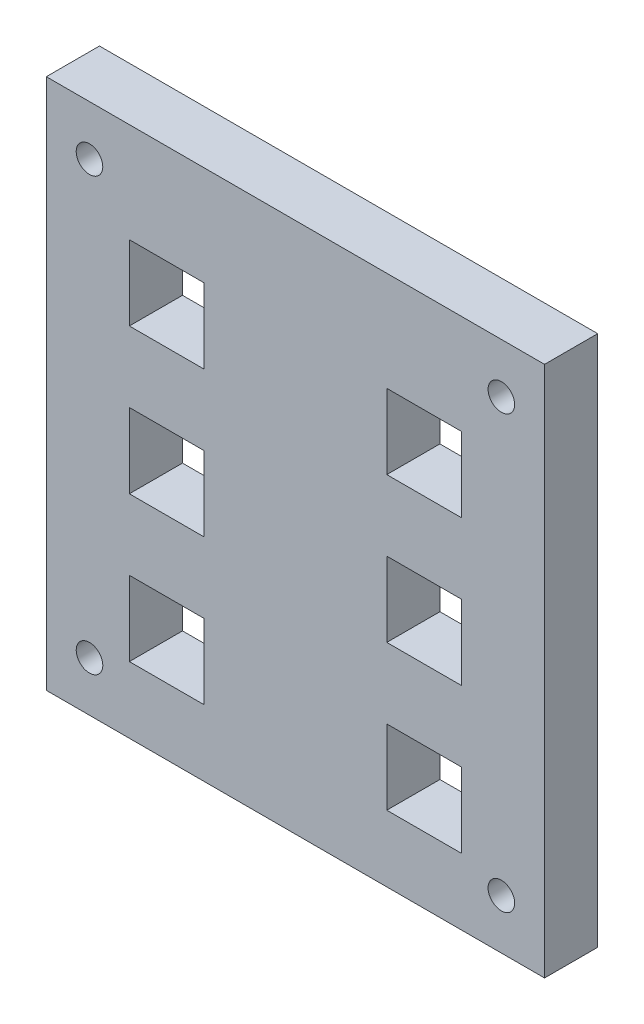
ISO-10303-21;
HEADER;
FILE_DESCRIPTION(('STEP AP214'),'2;1');
FILE_NAME('part.step','',(''),(''),'','','');
FILE_SCHEMA(('AUTOMOTIVE_DESIGN { 1 0 10303 214 1 1 1 1 }'));
ENDSEC;
DATA;
#1=APPLICATION_CONTEXT('core data for automotive mechanical design processes');
#2=APPLICATION_PROTOCOL_DEFINITION('international standard','automotive_design',2000,#1);
#3=PRODUCT_CONTEXT('',#1,'mechanical');
#4=PRODUCT('Part','Part','',(#3));
#5=PRODUCT_RELATED_PRODUCT_CATEGORY('part','',(#4));
#6=PRODUCT_DEFINITION_FORMATION('','',#4);
#7=PRODUCT_DEFINITION_CONTEXT('part definition',#1,'design');
#8=PRODUCT_DEFINITION('design','',#6,#7);
#9=PRODUCT_DEFINITION_SHAPE('','',#8);
#10=(LENGTH_UNIT() NAMED_UNIT(*) SI_UNIT(.MILLI.,.METRE.));
#11=(NAMED_UNIT(*) PLANE_ANGLE_UNIT() SI_UNIT($,.RADIAN.));
#12=(NAMED_UNIT(*) SI_UNIT($,.STERADIAN.) SOLID_ANGLE_UNIT());
#13=UNCERTAINTY_MEASURE_WITH_UNIT(LENGTH_MEASURE(1.E-05),#10,'distance_accuracy_value','');
#14=(GEOMETRIC_REPRESENTATION_CONTEXT(3) GLOBAL_UNCERTAINTY_ASSIGNED_CONTEXT((#13)) GLOBAL_UNIT_ASSIGNED_CONTEXT((#10,
#11,#12)) REPRESENTATION_CONTEXT('',''));
#15=CARTESIAN_POINT('',(0.,0.,0.));
#16=DIRECTION('',(0.,0.,1.));
#17=DIRECTION('',(1.,0.,0.));
#18=AXIS2_PLACEMENT_3D('',#15,#16,#17);
#19=CARTESIAN_POINT('',(-75.,-80.,16.));
#20=DIRECTION('',(1.,0.,0.));
#21=DIRECTION('',(0.,0.,-1.));
#22=AXIS2_PLACEMENT_3D('',#19,#20,#21);
#23=PLANE('',#22);
#24=DIRECTION('',(0.,-1.,0.));
#25=VECTOR('',#24,1.);
#26=CARTESIAN_POINT('',(-75.,-80.,0.));
#27=LINE('',#26,#25);
#28=CARTESIAN_POINT('',(-75.,80.,0.));
#29=VERTEX_POINT('',#28);
#30=CARTESIAN_POINT('',(-75.,-80.,0.));
#31=VERTEX_POINT('',#30);
#32=EDGE_CURVE('E429',#29,#31,#27,.T.);
#33=ORIENTED_EDGE('',*,*,#32,.T.);
#34=DIRECTION('',(0.,0.,-1.));
#35=VECTOR('',#34,1.);
#36=CARTESIAN_POINT('',(-75.,-80.,16.));
#37=LINE('',#36,#35);
#38=CARTESIAN_POINT('',(-75.,-80.,16.));
#39=VERTEX_POINT('',#38);
#40=EDGE_CURVE('E11',#39,#31,#37,.T.);
#41=ORIENTED_EDGE('',*,*,#40,.F.);
#42=DIRECTION('',(0.,-1.,0.));
#43=VECTOR('',#42,1.);
#44=CARTESIAN_POINT('',(-75.,-80.,16.));
#45=LINE('',#44,#43);
#46=CARTESIAN_POINT('',(-75.,80.,16.));
#47=VERTEX_POINT('',#46);
#48=EDGE_CURVE('E436',#47,#39,#45,.T.);
#49=ORIENTED_EDGE('',*,*,#48,.F.);
#50=DIRECTION('',(0.,0.,-1.));
#51=VECTOR('',#50,1.);
#52=CARTESIAN_POINT('',(-75.,80.,16.));
#53=LINE('',#52,#51);
#54=EDGE_CURVE('E446',#47,#29,#53,.T.);
#55=ORIENTED_EDGE('',*,*,#54,.T.);
#56=EDGE_LOOP('',(#33,#41,#49,#55));
#57=FACE_BOUND('',#56,.T.);
#58=ADVANCED_FACE('F32',(#57),#23,.F.);
#59=CARTESIAN_POINT('',(75.,-80.,16.));
#60=DIRECTION('',(0.,1.,0.));
#61=DIRECTION('',(-1.,0.,0.));
#62=AXIS2_PLACEMENT_3D('',#59,#60,#61);
#63=PLANE('',#62);
#64=DIRECTION('',(1.,0.,0.));
#65=VECTOR('',#64,1.);
#66=CARTESIAN_POINT('',(75.,-80.,0.));
#67=LINE('',#66,#65);
#68=CARTESIAN_POINT('',(75.,-80.,0.));
#69=VERTEX_POINT('',#68);
#70=EDGE_CURVE('E449',#31,#69,#67,.T.);
#71=ORIENTED_EDGE('',*,*,#70,.T.);
#72=DIRECTION('',(0.,0.,-1.));
#73=VECTOR('',#72,1.);
#74=CARTESIAN_POINT('',(75.,-80.,16.));
#75=LINE('',#74,#73);
#76=CARTESIAN_POINT('',(75.,-80.,16.));
#77=VERTEX_POINT('',#76);
#78=EDGE_CURVE('E39',#77,#69,#75,.T.);
#79=ORIENTED_EDGE('',*,*,#78,.F.);
#80=DIRECTION('',(1.,0.,0.));
#81=VECTOR('',#80,1.);
#82=CARTESIAN_POINT('',(75.,-80.,16.));
#83=LINE('',#82,#81);
#84=EDGE_CURVE('E439',#39,#77,#83,.T.);
#85=ORIENTED_EDGE('',*,*,#84,.F.);
#86=ORIENTED_EDGE('',*,*,#40,.T.);
#87=EDGE_LOOP('',(#71,#79,#85,#86));
#88=FACE_BOUND('',#87,.T.);
#89=ADVANCED_FACE('F478',(#88),#63,.F.);
#90=CARTESIAN_POINT('',(75.,-80.,16.));
#91=DIRECTION('',(-1.,0.,0.));
#92=DIRECTION('',(0.,0.,1.));
#93=AXIS2_PLACEMENT_3D('',#90,#91,#92);
#94=PLANE('',#93);
#95=DIRECTION('',(0.,1.,0.));
#96=VECTOR('',#95,1.);
#97=CARTESIAN_POINT('',(75.,-80.,0.));
#98=LINE('',#97,#96);
#99=CARTESIAN_POINT('',(75.,80.,0.));
#100=VERTEX_POINT('',#99);
#101=EDGE_CURVE('E451',#69,#100,#98,.T.);
#102=ORIENTED_EDGE('',*,*,#101,.T.);
#103=DIRECTION('',(0.,0.,-1.));
#104=VECTOR('',#103,1.);
#105=CARTESIAN_POINT('',(75.,80.,16.));
#106=LINE('',#105,#104);
#107=CARTESIAN_POINT('',(75.,80.,16.));
#108=VERTEX_POINT('',#107);
#109=EDGE_CURVE('E456',#108,#100,#106,.T.);
#110=ORIENTED_EDGE('',*,*,#109,.F.);
#111=DIRECTION('',(0.,1.,0.));
#112=VECTOR('',#111,1.);
#113=CARTESIAN_POINT('',(75.,-80.,16.));
#114=LINE('',#113,#112);
#115=EDGE_CURVE('E442',#77,#108,#114,.T.);
#116=ORIENTED_EDGE('',*,*,#115,.F.);
#117=ORIENTED_EDGE('',*,*,#78,.T.);
#118=EDGE_LOOP('',(#102,#110,#116,#117));
#119=FACE_BOUND('',#118,.T.);
#120=ADVANCED_FACE('F463',(#119),#94,.F.);
#121=CARTESIAN_POINT('',(75.,80.,16.));
#122=DIRECTION('',(0.,-1.,0.));
#123=DIRECTION('',(1.,0.,0.));
#124=AXIS2_PLACEMENT_3D('',#121,#122,#123);
#125=PLANE('',#124);
#126=DIRECTION('',(-1.,0.,0.));
#127=VECTOR('',#126,1.);
#128=CARTESIAN_POINT('',(75.,80.,0.));
#129=LINE('',#128,#127);
#130=EDGE_CURVE('E440',#100,#29,#129,.T.);
#131=ORIENTED_EDGE('',*,*,#130,.T.);
#132=ORIENTED_EDGE('',*,*,#54,.F.);
#133=DIRECTION('',(-1.,0.,0.));
#134=VECTOR('',#133,1.);
#135=CARTESIAN_POINT('',(75.,80.,16.));
#136=LINE('',#135,#134);
#137=EDGE_CURVE('E444',#108,#47,#136,.T.);
#138=ORIENTED_EDGE('',*,*,#137,.F.);
#139=ORIENTED_EDGE('',*,*,#109,.T.);
#140=EDGE_LOOP('',(#131,#132,#138,#139));
#141=FACE_BOUND('',#140,.T.);
#142=ADVANCED_FACE('F471',(#141),#125,.F.);
#143=CARTESIAN_POINT('',(0.,0.,16.));
#144=DIRECTION('',(0.,0.,1.));
#145=DIRECTION('',(1.,0.,0.));
#146=AXIS2_PLACEMENT_3D('',#143,#144,#145);
#147=PLANE('',#146);
#148=CARTESIAN_POINT('',(62.,-65.,16.));
#149=DIRECTION('',(0.,0.,1.));
#150=DIRECTION('',(1.,0.,0.));
#151=AXIS2_PLACEMENT_3D('',#148,#149,#150);
#152=CIRCLE('',#151,4.00000000000001);
#153=CARTESIAN_POINT('',(66.,-65.,16.));
#154=VERTEX_POINT('',#153);
#155=EDGE_CURVE('E274',#154,#154,#152,.T.);
#156=ORIENTED_EDGE('',*,*,#155,.F.);
#157=EDGE_LOOP('',(#156));
#158=FACE_BOUND('',#157,.T.);
#159=CARTESIAN_POINT('',(62.,65.,16.));
#160=DIRECTION('',(0.,0.,1.));
#161=DIRECTION('',(-1.,0.,0.));
#162=AXIS2_PLACEMENT_3D('',#159,#160,#161);
#163=CIRCLE('',#162,4.00000000000001);
#164=CARTESIAN_POINT('',(58.,65.,16.));
#165=VERTEX_POINT('',#164);
#166=EDGE_CURVE('E268',#165,#165,#163,.T.);
#167=ORIENTED_EDGE('',*,*,#166,.F.);
#168=EDGE_LOOP('',(#167));
#169=FACE_BOUND('',#168,.T.);
#170=CARTESIAN_POINT('',(-62.,65.,16.));
#171=DIRECTION('',(0.,0.,1.));
#172=DIRECTION('',(1.,0.,0.));
#173=AXIS2_PLACEMENT_3D('',#170,#171,#172);
#174=CIRCLE('',#173,4.00000000000001);
#175=CARTESIAN_POINT('',(-58.,65.,16.));
#176=VERTEX_POINT('',#175);
#177=EDGE_CURVE('E262',#176,#176,#174,.T.);
#178=ORIENTED_EDGE('',*,*,#177,.F.);
#179=EDGE_LOOP('',(#178));
#180=FACE_BOUND('',#179,.T.);
#181=DIRECTION('',(0.,-1.,0.));
#182=VECTOR('',#181,1.);
#183=CARTESIAN_POINT('',(27.5,-16.25,16.));
#184=LINE('',#183,#182);
#185=CARTESIAN_POINT('',(27.5,6.25000000000002,16.));
#186=VERTEX_POINT('',#185);
#187=CARTESIAN_POINT('',(27.5,-16.25,16.));
#188=VERTEX_POINT('',#187);
#189=EDGE_CURVE('E46',#186,#188,#184,.T.);
#190=ORIENTED_EDGE('',*,*,#189,.F.);
#191=DIRECTION('',(-1.,0.,0.));
#192=VECTOR('',#191,1.);
#193=CARTESIAN_POINT('',(27.5,6.25000000000002,16.));
#194=LINE('',#193,#192);
#195=CARTESIAN_POINT('',(50.,6.25000000000001,16.));
#196=VERTEX_POINT('',#195);
#197=EDGE_CURVE('E237',#196,#186,#194,.T.);
#198=ORIENTED_EDGE('',*,*,#197,.F.);
#199=DIRECTION('',(0.,1.,0.));
#200=VECTOR('',#199,1.);
#201=CARTESIAN_POINT('',(50.,-16.25,16.));
#202=LINE('',#201,#200);
#203=CARTESIAN_POINT('',(50.,-16.25,16.));
#204=VERTEX_POINT('',#203);
#205=EDGE_CURVE('E240',#204,#196,#202,.T.);
#206=ORIENTED_EDGE('',*,*,#205,.F.);
#207=DIRECTION('',(1.,0.,0.));
#208=VECTOR('',#207,1.);
#209=CARTESIAN_POINT('',(27.5,-16.25,16.));
#210=LINE('',#209,#208);
#211=EDGE_CURVE('E249',#188,#204,#210,.T.);
#212=ORIENTED_EDGE('',*,*,#211,.F.);
#213=EDGE_LOOP('',(#190,#198,#206,#212));
#214=FACE_BOUND('',#213,.T.);
#215=DIRECTION('',(-1.,0.,0.));
#216=VECTOR('',#215,1.);
#217=CARTESIAN_POINT('',(50.,50.,16.));
#218=LINE('',#217,#216);
#219=CARTESIAN_POINT('',(50.,50.,16.));
#220=VERTEX_POINT('',#219);
#221=CARTESIAN_POINT('',(27.5,50.,16.));
#222=VERTEX_POINT('',#221);
#223=EDGE_CURVE('E54',#220,#222,#218,.T.);
#224=ORIENTED_EDGE('',*,*,#223,.F.);
#225=DIRECTION('',(0.,1.,0.));
#226=VECTOR('',#225,1.);
#227=CARTESIAN_POINT('',(50.,50.,16.));
#228=LINE('',#227,#226);
#229=CARTESIAN_POINT('',(50.,27.5,16.));
#230=VERTEX_POINT('',#229);
#231=EDGE_CURVE('E346',#230,#220,#228,.T.);
#232=ORIENTED_EDGE('',*,*,#231,.F.);
#233=DIRECTION('',(1.,0.,0.));
#234=VECTOR('',#233,1.);
#235=CARTESIAN_POINT('',(50.,27.5,16.));
#236=LINE('',#235,#234);
#237=CARTESIAN_POINT('',(27.5,27.5,16.));
#238=VERTEX_POINT('',#237);
#239=EDGE_CURVE('E361',#238,#230,#236,.T.);
#240=ORIENTED_EDGE('',*,*,#239,.F.);
#241=DIRECTION('',(0.,-1.,0.));
#242=VECTOR('',#241,1.);
#243=CARTESIAN_POINT('',(27.5,50.,16.));
#244=LINE('',#243,#242);
#245=EDGE_CURVE('E357',#222,#238,#244,.T.);
#246=ORIENTED_EDGE('',*,*,#245,.F.);
#247=EDGE_LOOP('',(#224,#232,#240,#246));
#248=FACE_BOUND('',#247,.T.);
#249=DIRECTION('',(0.,-1.,0.));
#250=VECTOR('',#249,1.);
#251=CARTESIAN_POINT('',(-50.,-60.,16.));
#252=LINE('',#251,#250);
#253=CARTESIAN_POINT('',(-50.,-37.5,16.));
#254=VERTEX_POINT('',#253);
#255=CARTESIAN_POINT('',(-50.,-60.,16.));
#256=VERTEX_POINT('',#255);
#257=EDGE_CURVE('E305',#254,#256,#252,.T.);
#258=ORIENTED_EDGE('',*,*,#257,.F.);
#259=DIRECTION('',(-1.,0.,0.));
#260=VECTOR('',#259,1.);
#261=CARTESIAN_POINT('',(-50.,-37.5,16.));
#262=LINE('',#261,#260);
#263=CARTESIAN_POINT('',(-27.5,-37.5,16.));
#264=VERTEX_POINT('',#263);
#265=EDGE_CURVE('E378',#264,#254,#262,.T.);
#266=ORIENTED_EDGE('',*,*,#265,.F.);
#267=DIRECTION('',(0.,1.,0.));
#268=VECTOR('',#267,1.);
#269=CARTESIAN_POINT('',(-27.5,-60.,16.));
#270=LINE('',#269,#268);
#271=CARTESIAN_POINT('',(-27.5,-60.,16.));
#272=VERTEX_POINT('',#271);
#273=EDGE_CURVE('E392',#272,#264,#270,.T.);
#274=ORIENTED_EDGE('',*,*,#273,.F.);
#275=DIRECTION('',(1.,0.,0.));
#276=VECTOR('',#275,1.);
#277=CARTESIAN_POINT('',(-50.,-60.,16.));
#278=LINE('',#277,#276);
#279=EDGE_CURVE('E389',#256,#272,#278,.T.);
#280=ORIENTED_EDGE('',*,*,#279,.F.);
#281=EDGE_LOOP('',(#258,#266,#274,#280));
#282=FACE_BOUND('',#281,.T.);
#283=DIRECTION('',(1.,0.,0.));
#284=VECTOR('',#283,1.);
#285=CARTESIAN_POINT('',(50.,-60.,16.));
#286=LINE('',#285,#284);
#287=CARTESIAN_POINT('',(27.5,-60.,16.));
#288=VERTEX_POINT('',#287);
#289=CARTESIAN_POINT('',(50.,-60.,16.));
#290=VERTEX_POINT('',#289);
#291=EDGE_CURVE('E292',#288,#290,#286,.T.);
#292=ORIENTED_EDGE('',*,*,#291,.F.);
#293=DIRECTION('',(0.,-1.,0.));
#294=VECTOR('',#293,1.);
#295=CARTESIAN_POINT('',(27.5,-60.,16.));
#296=LINE('',#295,#294);
#297=CARTESIAN_POINT('',(27.5,-37.5,16.));
#298=VERTEX_POINT('',#297);
#299=EDGE_CURVE('E282',#298,#288,#296,.T.);
#300=ORIENTED_EDGE('',*,*,#299,.F.);
#301=DIRECTION('',(-1.,0.,0.));
#302=VECTOR('',#301,1.);
#303=CARTESIAN_POINT('',(50.,-37.5,16.));
#304=LINE('',#303,#302);
#305=CARTESIAN_POINT('',(50.,-37.5,16.));
#306=VERTEX_POINT('',#305);
#307=EDGE_CURVE('E298',#306,#298,#304,.T.);
#308=ORIENTED_EDGE('',*,*,#307,.F.);
#309=DIRECTION('',(0.,1.,0.));
#310=VECTOR('',#309,1.);
#311=CARTESIAN_POINT('',(50.,-60.,16.));
#312=LINE('',#311,#310);
#313=EDGE_CURVE('E294',#290,#306,#312,.T.);
#314=ORIENTED_EDGE('',*,*,#313,.F.);
#315=EDGE_LOOP('',(#292,#300,#308,#314));
#316=FACE_BOUND('',#315,.T.);
#317=DIRECTION('',(0.,-1.,0.));
#318=VECTOR('',#317,1.);
#319=CARTESIAN_POINT('',(-50.,-16.25,16.));
#320=LINE('',#319,#318);
#321=CARTESIAN_POINT('',(-50.,6.25000000000001,16.));
#322=VERTEX_POINT('',#321);
#323=CARTESIAN_POINT('',(-50.,-16.25,16.));
#324=VERTEX_POINT('',#323);
#325=EDGE_CURVE('E256',#322,#324,#320,.T.);
#326=ORIENTED_EDGE('',*,*,#325,.F.);
#327=DIRECTION('',(-1.,0.,0.));
#328=VECTOR('',#327,1.);
#329=CARTESIAN_POINT('',(-27.5,6.25000000000002,16.));
#330=LINE('',#329,#328);
#331=CARTESIAN_POINT('',(-27.5,6.25000000000002,16.));
#332=VERTEX_POINT('',#331);
#333=EDGE_CURVE('E316',#332,#322,#330,.T.);
#334=ORIENTED_EDGE('',*,*,#333,.F.);
#335=DIRECTION('',(0.,1.,0.));
#336=VECTOR('',#335,1.);
#337=CARTESIAN_POINT('',(-27.5,-16.25,16.));
#338=LINE('',#337,#336);
#339=CARTESIAN_POINT('',(-27.5,-16.25,16.));
#340=VERTEX_POINT('',#339);
#341=EDGE_CURVE('E330',#340,#332,#338,.T.);
#342=ORIENTED_EDGE('',*,*,#341,.F.);
#343=DIRECTION('',(1.,0.,0.));
#344=VECTOR('',#343,1.);
#345=CARTESIAN_POINT('',(-27.5,-16.25,16.));
#346=LINE('',#345,#344);
#347=EDGE_CURVE('E327',#324,#340,#346,.T.);
#348=ORIENTED_EDGE('',*,*,#347,.F.);
#349=EDGE_LOOP('',(#326,#334,#342,#348));
#350=FACE_BOUND('',#349,.T.);
#351=CARTESIAN_POINT('',(-62.,-65.,16.));
#352=DIRECTION('',(0.,0.,1.));
#353=DIRECTION('',(-1.,0.,0.));
#354=AXIS2_PLACEMENT_3D('',#351,#352,#353);
#355=CIRCLE('',#354,4.00000000000001);
#356=CARTESIAN_POINT('',(-66.,-65.,16.));
#357=VERTEX_POINT('',#356);
#358=EDGE_CURVE('E243',#357,#357,#355,.T.);
#359=ORIENTED_EDGE('',*,*,#358,.F.);
#360=EDGE_LOOP('',(#359));
#361=FACE_BOUND('',#360,.T.);
#362=DIRECTION('',(0.,-1.,0.));
#363=VECTOR('',#362,1.);
#364=CARTESIAN_POINT('',(-50.,50.,16.));
#365=LINE('',#364,#363);
#366=CARTESIAN_POINT('',(-50.,50.,16.));
#367=VERTEX_POINT('',#366);
#368=CARTESIAN_POINT('',(-50.,27.5,16.));
#369=VERTEX_POINT('',#368);
#370=EDGE_CURVE('E368',#367,#369,#365,.T.);
#371=ORIENTED_EDGE('',*,*,#370,.F.);
#372=DIRECTION('',(-1.,0.,0.));
#373=VECTOR('',#372,1.);
#374=CARTESIAN_POINT('',(-50.,50.,16.));
#375=LINE('',#374,#373);
#376=CARTESIAN_POINT('',(-27.5,50.,16.));
#377=VERTEX_POINT('',#376);
#378=EDGE_CURVE('E408',#377,#367,#375,.T.);
#379=ORIENTED_EDGE('',*,*,#378,.F.);
#380=DIRECTION('',(0.,1.,0.));
#381=VECTOR('',#380,1.);
#382=CARTESIAN_POINT('',(-27.5,50.,16.));
#383=LINE('',#382,#381);
#384=CARTESIAN_POINT('',(-27.5,27.5,16.));
#385=VERTEX_POINT('',#384);
#386=EDGE_CURVE('E422',#385,#377,#383,.T.);
#387=ORIENTED_EDGE('',*,*,#386,.F.);
#388=DIRECTION('',(1.,0.,0.));
#389=VECTOR('',#388,1.);
#390=CARTESIAN_POINT('',(-50.,27.5,16.));
#391=LINE('',#390,#389);
#392=EDGE_CURVE('E419',#369,#385,#391,.T.);
#393=ORIENTED_EDGE('',*,*,#392,.F.);
#394=EDGE_LOOP('',(#371,#379,#387,#393));
#395=FACE_BOUND('',#394,.T.);
#396=ORIENTED_EDGE('',*,*,#48,.T.);
#397=ORIENTED_EDGE('',*,*,#84,.T.);
#398=ORIENTED_EDGE('',*,*,#115,.T.);
#399=ORIENTED_EDGE('',*,*,#137,.T.);
#400=EDGE_LOOP('',(#396,#397,#398,#399));
#401=FACE_BOUND('',#400,.T.);
#402=ADVANCED_FACE('F477',(#158,#169,#180,#214,#248,#282,#316,#350,#361,#395,#401),#147,.T.);
#403=CARTESIAN_POINT('',(0.,0.,0.));
#404=DIRECTION('',(0.,0.,1.));
#405=DIRECTION('',(1.,0.,0.));
#406=AXIS2_PLACEMENT_3D('',#403,#404,#405);
#407=PLANE('',#406);
#408=CARTESIAN_POINT('',(62.,-65.,0.));
#409=DIRECTION('',(0.,0.,1.));
#410=DIRECTION('',(1.,0.,0.));
#411=AXIS2_PLACEMENT_3D('',#408,#409,#410);
#412=CIRCLE('',#411,4.00000000000001);
#413=CARTESIAN_POINT('',(66.,-65.,0.));
#414=VERTEX_POINT('',#413);
#415=EDGE_CURVE('E271',#414,#414,#412,.T.);
#416=ORIENTED_EDGE('',*,*,#415,.T.);
#417=EDGE_LOOP('',(#416));
#418=FACE_BOUND('',#417,.T.);
#419=CARTESIAN_POINT('',(62.,65.,0.));
#420=DIRECTION('',(0.,0.,1.));
#421=DIRECTION('',(-1.,0.,0.));
#422=AXIS2_PLACEMENT_3D('',#419,#420,#421);
#423=CIRCLE('',#422,4.00000000000001);
#424=CARTESIAN_POINT('',(58.,65.,0.));
#425=VERTEX_POINT('',#424);
#426=EDGE_CURVE('E265',#425,#425,#423,.T.);
#427=ORIENTED_EDGE('',*,*,#426,.T.);
#428=EDGE_LOOP('',(#427));
#429=FACE_BOUND('',#428,.T.);
#430=CARTESIAN_POINT('',(-62.,65.,0.));
#431=DIRECTION('',(0.,0.,1.));
#432=DIRECTION('',(1.,0.,0.));
#433=AXIS2_PLACEMENT_3D('',#430,#431,#432);
#434=CIRCLE('',#433,4.00000000000001);
#435=CARTESIAN_POINT('',(-58.,65.,0.));
#436=VERTEX_POINT('',#435);
#437=EDGE_CURVE('E250',#436,#436,#434,.T.);
#438=ORIENTED_EDGE('',*,*,#437,.T.);
#439=EDGE_LOOP('',(#438));
#440=FACE_BOUND('',#439,.T.);
#441=DIRECTION('',(-1.,0.,0.));
#442=VECTOR('',#441,1.);
#443=CARTESIAN_POINT('',(27.5,6.25000000000002,0.));
#444=LINE('',#443,#442);
#445=CARTESIAN_POINT('',(50.,6.25000000000001,0.));
#446=VERTEX_POINT('',#445);
#447=CARTESIAN_POINT('',(27.5,6.25000000000002,0.));
#448=VERTEX_POINT('',#447);
#449=EDGE_CURVE('E224',#446,#448,#444,.T.);
#450=ORIENTED_EDGE('',*,*,#449,.T.);
#451=DIRECTION('',(0.,-1.,0.));
#452=VECTOR('',#451,1.);
#453=CARTESIAN_POINT('',(27.5,-16.25,0.));
#454=LINE('',#453,#452);
#455=CARTESIAN_POINT('',(27.5,-16.25,0.));
#456=VERTEX_POINT('',#455);
#457=EDGE_CURVE('E218',#448,#456,#454,.T.);
#458=ORIENTED_EDGE('',*,*,#457,.T.);
#459=DIRECTION('',(1.,0.,0.));
#460=VECTOR('',#459,1.);
#461=CARTESIAN_POINT('',(27.5,-16.25,0.));
#462=LINE('',#461,#460);
#463=CARTESIAN_POINT('',(50.,-16.25,0.));
#464=VERTEX_POINT('',#463);
#465=EDGE_CURVE('E228',#456,#464,#462,.T.);
#466=ORIENTED_EDGE('',*,*,#465,.T.);
#467=DIRECTION('',(0.,1.,0.));
#468=VECTOR('',#467,1.);
#469=CARTESIAN_POINT('',(50.,-16.25,0.));
#470=LINE('',#469,#468);
#471=EDGE_CURVE('E232',#464,#446,#470,.T.);
#472=ORIENTED_EDGE('',*,*,#471,.T.);
#473=EDGE_LOOP('',(#450,#458,#466,#472));
#474=FACE_BOUND('',#473,.T.);
#475=DIRECTION('',(0.,1.,0.));
#476=VECTOR('',#475,1.);
#477=CARTESIAN_POINT('',(50.,50.,0.));
#478=LINE('',#477,#476);
#479=CARTESIAN_POINT('',(50.,27.5,0.));
#480=VERTEX_POINT('',#479);
#481=CARTESIAN_POINT('',(50.,50.,0.));
#482=VERTEX_POINT('',#481);
#483=EDGE_CURVE('E352',#480,#482,#478,.T.);
#484=ORIENTED_EDGE('',*,*,#483,.T.);
#485=DIRECTION('',(-1.,0.,0.));
#486=VECTOR('',#485,1.);
#487=CARTESIAN_POINT('',(50.,50.,0.));
#488=LINE('',#487,#486);
#489=CARTESIAN_POINT('',(27.5,50.,0.));
#490=VERTEX_POINT('',#489);
#491=EDGE_CURVE('E342',#482,#490,#488,.T.);
#492=ORIENTED_EDGE('',*,*,#491,.T.);
#493=DIRECTION('',(0.,-1.,0.));
#494=VECTOR('',#493,1.);
#495=CARTESIAN_POINT('',(27.5,50.,0.));
#496=LINE('',#495,#494);
#497=CARTESIAN_POINT('',(27.5,27.5,0.));
#498=VERTEX_POINT('',#497);
#499=EDGE_CURVE('E345',#490,#498,#496,.T.);
#500=ORIENTED_EDGE('',*,*,#499,.T.);
#501=DIRECTION('',(1.,0.,0.));
#502=VECTOR('',#501,1.);
#503=CARTESIAN_POINT('',(50.,27.5,0.));
#504=LINE('',#503,#502);
#505=EDGE_CURVE('E349',#498,#480,#504,.T.);
#506=ORIENTED_EDGE('',*,*,#505,.T.);
#507=EDGE_LOOP('',(#484,#492,#500,#506));
#508=FACE_BOUND('',#507,.T.);
#509=DIRECTION('',(-1.,0.,0.));
#510=VECTOR('',#509,1.);
#511=CARTESIAN_POINT('',(-50.,-37.5,0.));
#512=LINE('',#511,#510);
#513=CARTESIAN_POINT('',(-27.5,-37.5,0.));
#514=VERTEX_POINT('',#513);
#515=CARTESIAN_POINT('',(-50.,-37.5,0.));
#516=VERTEX_POINT('',#515);
#517=EDGE_CURVE('E384',#514,#516,#512,.T.);
#518=ORIENTED_EDGE('',*,*,#517,.T.);
#519=DIRECTION('',(0.,-1.,0.));
#520=VECTOR('',#519,1.);
#521=CARTESIAN_POINT('',(-50.,-60.,0.));
#522=LINE('',#521,#520);
#523=CARTESIAN_POINT('',(-50.,-60.,0.));
#524=VERTEX_POINT('',#523);
#525=EDGE_CURVE('E374',#516,#524,#522,.T.);
#526=ORIENTED_EDGE('',*,*,#525,.T.);
#527=DIRECTION('',(1.,0.,0.));
#528=VECTOR('',#527,1.);
#529=CARTESIAN_POINT('',(-50.,-60.,0.));
#530=LINE('',#529,#528);
#531=CARTESIAN_POINT('',(-27.5,-60.,0.));
#532=VERTEX_POINT('',#531);
#533=EDGE_CURVE('E377',#524,#532,#530,.T.);
#534=ORIENTED_EDGE('',*,*,#533,.T.);
#535=DIRECTION('',(0.,1.,0.));
#536=VECTOR('',#535,1.);
#537=CARTESIAN_POINT('',(-27.5,-60.,0.));
#538=LINE('',#537,#536);
#539=EDGE_CURVE('E381',#532,#514,#538,.T.);
#540=ORIENTED_EDGE('',*,*,#539,.T.);
#541=EDGE_LOOP('',(#518,#526,#534,#540));
#542=FACE_BOUND('',#541,.T.);
#543=DIRECTION('',(0.,-1.,0.));
#544=VECTOR('',#543,1.);
#545=CARTESIAN_POINT('',(27.5,-60.,0.));
#546=LINE('',#545,#544);
#547=CARTESIAN_POINT('',(27.5,-37.5,0.));
#548=VERTEX_POINT('',#547);
#549=CARTESIAN_POINT('',(27.5,-60.,0.));
#550=VERTEX_POINT('',#549);
#551=EDGE_CURVE('E288',#548,#550,#546,.T.);
#552=ORIENTED_EDGE('',*,*,#551,.T.);
#553=DIRECTION('',(1.,0.,0.));
#554=VECTOR('',#553,1.);
#555=CARTESIAN_POINT('',(50.,-60.,0.));
#556=LINE('',#555,#554);
#557=CARTESIAN_POINT('',(50.,-60.,0.));
#558=VERTEX_POINT('',#557);
#559=EDGE_CURVE('E278',#550,#558,#556,.T.);
#560=ORIENTED_EDGE('',*,*,#559,.T.);
#561=DIRECTION('',(0.,1.,0.));
#562=VECTOR('',#561,1.);
#563=CARTESIAN_POINT('',(50.,-60.,0.));
#564=LINE('',#563,#562);
#565=CARTESIAN_POINT('',(50.,-37.5,0.));
#566=VERTEX_POINT('',#565);
#567=EDGE_CURVE('E281',#558,#566,#564,.T.);
#568=ORIENTED_EDGE('',*,*,#567,.T.);
#569=DIRECTION('',(-1.,0.,0.));
#570=VECTOR('',#569,1.);
#571=CARTESIAN_POINT('',(50.,-37.5,0.));
#572=LINE('',#571,#570);
#573=EDGE_CURVE('E285',#566,#548,#572,.T.);
#574=ORIENTED_EDGE('',*,*,#573,.T.);
#575=EDGE_LOOP('',(#552,#560,#568,#574));
#576=FACE_BOUND('',#575,.T.);
#577=DIRECTION('',(-1.,0.,0.));
#578=VECTOR('',#577,1.);
#579=CARTESIAN_POINT('',(-27.5,6.25000000000002,0.));
#580=LINE('',#579,#578);
#581=CARTESIAN_POINT('',(-27.5,6.25000000000002,0.));
#582=VERTEX_POINT('',#581);
#583=CARTESIAN_POINT('',(-50.,6.25000000000001,0.));
#584=VERTEX_POINT('',#583);
#585=EDGE_CURVE('E322',#582,#584,#580,.T.);
#586=ORIENTED_EDGE('',*,*,#585,.T.);
#587=DIRECTION('',(0.,-1.,0.));
#588=VECTOR('',#587,1.);
#589=CARTESIAN_POINT('',(-50.,-16.25,0.));
#590=LINE('',#589,#588);
#591=CARTESIAN_POINT('',(-50.,-16.25,0.));
#592=VERTEX_POINT('',#591);
#593=EDGE_CURVE('E312',#584,#592,#590,.T.);
#594=ORIENTED_EDGE('',*,*,#593,.T.);
#595=DIRECTION('',(1.,0.,0.));
#596=VECTOR('',#595,1.);
#597=CARTESIAN_POINT('',(-27.5,-16.25,0.));
#598=LINE('',#597,#596);
#599=CARTESIAN_POINT('',(-27.5,-16.25,0.));
#600=VERTEX_POINT('',#599);
#601=EDGE_CURVE('E315',#592,#600,#598,.T.);
#602=ORIENTED_EDGE('',*,*,#601,.T.);
#603=DIRECTION('',(0.,1.,0.));
#604=VECTOR('',#603,1.);
#605=CARTESIAN_POINT('',(-27.5,-16.25,0.));
#606=LINE('',#605,#604);
#607=EDGE_CURVE('E319',#600,#582,#606,.T.);
#608=ORIENTED_EDGE('',*,*,#607,.T.);
#609=EDGE_LOOP('',(#586,#594,#602,#608));
#610=FACE_BOUND('',#609,.T.);
#611=CARTESIAN_POINT('',(-62.,-65.,0.));
#612=DIRECTION('',(0.,0.,1.));
#613=DIRECTION('',(-1.,0.,0.));
#614=AXIS2_PLACEMENT_3D('',#611,#612,#613);
#615=CIRCLE('',#614,4.00000000000001);
#616=CARTESIAN_POINT('',(-66.,-65.,0.));
#617=VERTEX_POINT('',#616);
#618=EDGE_CURVE('E277',#617,#617,#615,.T.);
#619=ORIENTED_EDGE('',*,*,#618,.T.);
#620=EDGE_LOOP('',(#619));
#621=FACE_BOUND('',#620,.T.);
#622=DIRECTION('',(-1.,0.,0.));
#623=VECTOR('',#622,1.);
#624=CARTESIAN_POINT('',(-50.,50.,0.));
#625=LINE('',#624,#623);
#626=CARTESIAN_POINT('',(-27.5,50.,0.));
#627=VERTEX_POINT('',#626);
#628=CARTESIAN_POINT('',(-50.,50.,0.));
#629=VERTEX_POINT('',#628);
#630=EDGE_CURVE('E414',#627,#629,#625,.T.);
#631=ORIENTED_EDGE('',*,*,#630,.T.);
#632=DIRECTION('',(0.,-1.,0.));
#633=VECTOR('',#632,1.);
#634=CARTESIAN_POINT('',(-50.,50.,0.));
#635=LINE('',#634,#633);
#636=CARTESIAN_POINT('',(-50.,27.5,0.));
#637=VERTEX_POINT('',#636);
#638=EDGE_CURVE('E404',#629,#637,#635,.T.);
#639=ORIENTED_EDGE('',*,*,#638,.T.);
#640=DIRECTION('',(1.,0.,0.));
#641=VECTOR('',#640,1.);
#642=CARTESIAN_POINT('',(-50.,27.5,0.));
#643=LINE('',#642,#641);
#644=CARTESIAN_POINT('',(-27.5,27.5,0.));
#645=VERTEX_POINT('',#644);
#646=EDGE_CURVE('E407',#637,#645,#643,.T.);
#647=ORIENTED_EDGE('',*,*,#646,.T.);
#648=DIRECTION('',(0.,1.,0.));
#649=VECTOR('',#648,1.);
#650=CARTESIAN_POINT('',(-27.5,50.,0.));
#651=LINE('',#650,#649);
#652=EDGE_CURVE('E411',#645,#627,#651,.T.);
#653=ORIENTED_EDGE('',*,*,#652,.T.);
#654=EDGE_LOOP('',(#631,#639,#647,#653));
#655=FACE_BOUND('',#654,.T.);
#656=ORIENTED_EDGE('',*,*,#32,.F.);
#657=ORIENTED_EDGE('',*,*,#130,.F.);
#658=ORIENTED_EDGE('',*,*,#101,.F.);
#659=ORIENTED_EDGE('',*,*,#70,.F.);
#660=EDGE_LOOP('',(#656,#657,#658,#659));
#661=FACE_BOUND('',#660,.T.);
#662=ADVANCED_FACE('F234',(#418,#429,#440,#474,#508,#542,#576,#610,#621,#655,#661),#407,.F.);
#663=CARTESIAN_POINT('',(-50.,50.,0.));
#664=DIRECTION('',(-1.,0.,0.));
#665=DIRECTION('',(0.,0.,1.));
#666=AXIS2_PLACEMENT_3D('',#663,#664,#665);
#667=PLANE('',#666);
#668=ORIENTED_EDGE('',*,*,#370,.T.);
#669=DIRECTION('',(0.,0.,1.));
#670=VECTOR('',#669,1.);
#671=CARTESIAN_POINT('',(-50.,27.5,0.));
#672=LINE('',#671,#670);
#673=EDGE_CURVE('E417',#637,#369,#672,.T.);
#674=ORIENTED_EDGE('',*,*,#673,.F.);
#675=ORIENTED_EDGE('',*,*,#638,.F.);
#676=DIRECTION('',(0.,0.,1.));
#677=VECTOR('',#676,1.);
#678=CARTESIAN_POINT('',(-50.,50.,0.));
#679=LINE('',#678,#677);
#680=EDGE_CURVE('E427',#629,#367,#679,.T.);
#681=ORIENTED_EDGE('',*,*,#680,.T.);
#682=EDGE_LOOP('',(#668,#674,#675,#681));
#683=FACE_BOUND('',#682,.T.);
#684=ADVANCED_FACE('F490',(#683),#667,.F.);
#685=CARTESIAN_POINT('',(-50.,50.,0.));
#686=DIRECTION('',(0.,1.,0.));
#687=DIRECTION('',(-1.,0.,0.));
#688=AXIS2_PLACEMENT_3D('',#685,#686,#687);
#689=PLANE('',#688);
#690=ORIENTED_EDGE('',*,*,#378,.T.);
#691=ORIENTED_EDGE('',*,*,#680,.F.);
#692=ORIENTED_EDGE('',*,*,#630,.F.);
#693=DIRECTION('',(0.,0.,1.));
#694=VECTOR('',#693,1.);
#695=CARTESIAN_POINT('',(-27.5,50.,0.));
#696=LINE('',#695,#694);
#697=EDGE_CURVE('E430',#627,#377,#696,.T.);
#698=ORIENTED_EDGE('',*,*,#697,.T.);
#699=EDGE_LOOP('',(#690,#691,#692,#698));
#700=FACE_BOUND('',#699,.T.);
#701=ADVANCED_FACE('F497',(#700),#689,.F.);
#702=CARTESIAN_POINT('',(-27.5,50.,0.));
#703=DIRECTION('',(1.,0.,0.));
#704=DIRECTION('',(0.,1.,0.));
#705=AXIS2_PLACEMENT_3D('',#702,#703,#704);
#706=PLANE('',#705);
#707=ORIENTED_EDGE('',*,*,#386,.T.);
#708=ORIENTED_EDGE('',*,*,#697,.F.);
#709=ORIENTED_EDGE('',*,*,#652,.F.);
#710=DIRECTION('',(0.,0.,1.));
#711=VECTOR('',#710,1.);
#712=CARTESIAN_POINT('',(-27.5,27.5,0.));
#713=LINE('',#712,#711);
#714=EDGE_CURVE('E432',#645,#385,#713,.T.);
#715=ORIENTED_EDGE('',*,*,#714,.T.);
#716=EDGE_LOOP('',(#707,#708,#709,#715));
#717=FACE_BOUND('',#716,.T.);
#718=ADVANCED_FACE('F503',(#717),#706,.F.);
#719=CARTESIAN_POINT('',(-50.,27.5,0.));
#720=DIRECTION('',(0.,-1.,0.));
#721=DIRECTION('',(0.,0.,-1.));
#722=AXIS2_PLACEMENT_3D('',#719,#720,#721);
#723=PLANE('',#722);
#724=ORIENTED_EDGE('',*,*,#392,.T.);
#725=ORIENTED_EDGE('',*,*,#714,.F.);
#726=ORIENTED_EDGE('',*,*,#646,.F.);
#727=ORIENTED_EDGE('',*,*,#673,.T.);
#728=EDGE_LOOP('',(#724,#725,#726,#727));
#729=FACE_BOUND('',#728,.T.);
#730=ADVANCED_FACE('F499',(#729),#723,.F.);
#731=CARTESIAN_POINT('',(-62.,-65.,0.));
#732=DIRECTION('',(0.,0.,1.));
#733=DIRECTION('',(1.,0.,0.));
#734=AXIS2_PLACEMENT_3D('',#731,#732,#733);
#735=CYLINDRICAL_SURFACE('',#734,4.00000000000001);
#736=ORIENTED_EDGE('',*,*,#618,.F.);
#737=EDGE_LOOP('',(#736));
#738=FACE_BOUND('',#737,.T.);
#739=ORIENTED_EDGE('',*,*,#358,.T.);
#740=EDGE_LOOP('',(#739));
#741=FACE_BOUND('',#740,.T.);
#742=ADVANCED_FACE('F502',(#738,#741),#735,.F.);
#743=CARTESIAN_POINT('',(-50.,-16.25,0.));
#744=DIRECTION('',(-1.,0.,0.));
#745=DIRECTION('',(0.,0.,1.));
#746=AXIS2_PLACEMENT_3D('',#743,#744,#745);
#747=PLANE('',#746);
#748=ORIENTED_EDGE('',*,*,#325,.T.);
#749=DIRECTION('',(0.,0.,1.));
#750=VECTOR('',#749,1.);
#751=CARTESIAN_POINT('',(-50.,-16.25,0.));
#752=LINE('',#751,#750);
#753=EDGE_CURVE('E325',#592,#324,#752,.T.);
#754=ORIENTED_EDGE('',*,*,#753,.F.);
#755=ORIENTED_EDGE('',*,*,#593,.F.);
#756=DIRECTION('',(0.,0.,1.));
#757=VECTOR('',#756,1.);
#758=CARTESIAN_POINT('',(-50.,6.25000000000001,0.));
#759=LINE('',#758,#757);
#760=EDGE_CURVE('E295',#584,#322,#759,.T.);
#761=ORIENTED_EDGE('',*,*,#760,.T.);
#762=EDGE_LOOP('',(#748,#754,#755,#761));
#763=FACE_BOUND('',#762,.T.);
#764=ADVANCED_FACE('F543',(#763),#747,.F.);
#765=CARTESIAN_POINT('',(-27.5,6.25000000000002,0.));
#766=DIRECTION('',(0.,1.,0.));
#767=DIRECTION('',(-1.,0.,0.));
#768=AXIS2_PLACEMENT_3D('',#765,#766,#767);
#769=PLANE('',#768);
#770=ORIENTED_EDGE('',*,*,#333,.T.);
#771=ORIENTED_EDGE('',*,*,#760,.F.);
#772=ORIENTED_EDGE('',*,*,#585,.F.);
#773=DIRECTION('',(0.,0.,1.));
#774=VECTOR('',#773,1.);
#775=CARTESIAN_POINT('',(-27.5,6.25000000000002,0.));
#776=LINE('',#775,#774);
#777=EDGE_CURVE('E336',#582,#332,#776,.T.);
#778=ORIENTED_EDGE('',*,*,#777,.T.);
#779=EDGE_LOOP('',(#770,#771,#772,#778));
#780=FACE_BOUND('',#779,.T.);
#781=ADVANCED_FACE('F546',(#780),#769,.F.);
#782=CARTESIAN_POINT('',(-27.5,-16.25,0.));
#783=DIRECTION('',(1.,0.,0.));
#784=DIRECTION('',(0.,0.,-1.));
#785=AXIS2_PLACEMENT_3D('',#782,#783,#784);
#786=PLANE('',#785);
#787=ORIENTED_EDGE('',*,*,#341,.T.);
#788=ORIENTED_EDGE('',*,*,#777,.F.);
#789=ORIENTED_EDGE('',*,*,#607,.F.);
#790=DIRECTION('',(0.,0.,1.));
#791=VECTOR('',#790,1.);
#792=CARTESIAN_POINT('',(-27.5,-16.25,0.));
#793=LINE('',#792,#791);
#794=EDGE_CURVE('E338',#600,#340,#793,.T.);
#795=ORIENTED_EDGE('',*,*,#794,.T.);
#796=EDGE_LOOP('',(#787,#788,#789,#795));
#797=FACE_BOUND('',#796,.T.);
#798=ADVANCED_FACE('F552',(#797),#786,.F.);
#799=CARTESIAN_POINT('',(-27.5,-16.25,0.));
#800=DIRECTION('',(0.,-1.,0.));
#801=DIRECTION('',(1.,0.,0.));
#802=AXIS2_PLACEMENT_3D('',#799,#800,#801);
#803=PLANE('',#802);
#804=ORIENTED_EDGE('',*,*,#347,.T.);
#805=ORIENTED_EDGE('',*,*,#794,.F.);
#806=ORIENTED_EDGE('',*,*,#601,.F.);
#807=ORIENTED_EDGE('',*,*,#753,.T.);
#808=EDGE_LOOP('',(#804,#805,#806,#807));
#809=FACE_BOUND('',#808,.T.);
#810=ADVANCED_FACE('F548',(#809),#803,.F.);
#811=CARTESIAN_POINT('',(50.,-60.,0.));
#812=DIRECTION('',(0.,-1.,0.));
#813=DIRECTION('',(1.,0.,0.));
#814=AXIS2_PLACEMENT_3D('',#811,#812,#813);
#815=PLANE('',#814);
#816=ORIENTED_EDGE('',*,*,#291,.T.);
#817=DIRECTION('',(0.,0.,1.));
#818=VECTOR('',#817,1.);
#819=CARTESIAN_POINT('',(50.,-60.,0.));
#820=LINE('',#819,#818);
#821=EDGE_CURVE('E291',#558,#290,#820,.T.);
#822=ORIENTED_EDGE('',*,*,#821,.F.);
#823=ORIENTED_EDGE('',*,*,#559,.F.);
#824=DIRECTION('',(0.,0.,1.));
#825=VECTOR('',#824,1.);
#826=CARTESIAN_POINT('',(27.5,-60.,0.));
#827=LINE('',#826,#825);
#828=EDGE_CURVE('E303',#550,#288,#827,.T.);
#829=ORIENTED_EDGE('',*,*,#828,.T.);
#830=EDGE_LOOP('',(#816,#822,#823,#829));
#831=FACE_BOUND('',#830,.T.);
#832=ADVANCED_FACE('F551',(#831),#815,.F.);
#833=CARTESIAN_POINT('',(27.5,-60.,0.));
#834=DIRECTION('',(-1.,0.,0.));
#835=DIRECTION('',(0.,0.,1.));
#836=AXIS2_PLACEMENT_3D('',#833,#834,#835);
#837=PLANE('',#836);
#838=ORIENTED_EDGE('',*,*,#299,.T.);
#839=ORIENTED_EDGE('',*,*,#828,.F.);
#840=ORIENTED_EDGE('',*,*,#551,.F.);
#841=DIRECTION('',(0.,0.,1.));
#842=VECTOR('',#841,1.);
#843=CARTESIAN_POINT('',(27.5,-37.5,0.));
#844=LINE('',#843,#842);
#845=EDGE_CURVE('E306',#548,#298,#844,.T.);
#846=ORIENTED_EDGE('',*,*,#845,.T.);
#847=EDGE_LOOP('',(#838,#839,#840,#846));
#848=FACE_BOUND('',#847,.T.);
#849=ADVANCED_FACE('F562',(#848),#837,.F.);
#850=CARTESIAN_POINT('',(50.,-37.5,0.));
#851=DIRECTION('',(0.,1.,0.));
#852=DIRECTION('',(0.,0.,1.));
#853=AXIS2_PLACEMENT_3D('',#850,#851,#852);
#854=PLANE('',#853);
#855=ORIENTED_EDGE('',*,*,#307,.T.);
#856=ORIENTED_EDGE('',*,*,#845,.F.);
#857=ORIENTED_EDGE('',*,*,#573,.F.);
#858=DIRECTION('',(0.,0.,1.));
#859=VECTOR('',#858,1.);
#860=CARTESIAN_POINT('',(50.,-37.5,0.));
#861=LINE('',#860,#859);
#862=EDGE_CURVE('E308',#566,#306,#861,.T.);
#863=ORIENTED_EDGE('',*,*,#862,.T.);
#864=EDGE_LOOP('',(#855,#856,#857,#863));
#865=FACE_BOUND('',#864,.T.);
#866=ADVANCED_FACE('F566',(#865),#854,.F.);
#867=CARTESIAN_POINT('',(50.,-60.,0.));
#868=DIRECTION('',(1.,0.,0.));
#869=DIRECTION('',(0.,0.,-1.));
#870=AXIS2_PLACEMENT_3D('',#867,#868,#869);
#871=PLANE('',#870);
#872=ORIENTED_EDGE('',*,*,#313,.T.);
#873=ORIENTED_EDGE('',*,*,#862,.F.);
#874=ORIENTED_EDGE('',*,*,#567,.F.);
#875=ORIENTED_EDGE('',*,*,#821,.T.);
#876=EDGE_LOOP('',(#872,#873,#874,#875));
#877=FACE_BOUND('',#876,.T.);
#878=ADVANCED_FACE('F515',(#877),#871,.F.);
#879=CARTESIAN_POINT('',(-50.,-60.,0.));
#880=DIRECTION('',(-1.,0.,0.));
#881=DIRECTION('',(0.,0.,1.));
#882=AXIS2_PLACEMENT_3D('',#879,#880,#881);
#883=PLANE('',#882);
#884=ORIENTED_EDGE('',*,*,#257,.T.);
#885=DIRECTION('',(0.,0.,1.));
#886=VECTOR('',#885,1.);
#887=CARTESIAN_POINT('',(-50.,-60.,0.));
#888=LINE('',#887,#886);
#889=EDGE_CURVE('E387',#524,#256,#888,.T.);
#890=ORIENTED_EDGE('',*,*,#889,.F.);
#891=ORIENTED_EDGE('',*,*,#525,.F.);
#892=DIRECTION('',(0.,0.,1.));
#893=VECTOR('',#892,1.);
#894=CARTESIAN_POINT('',(-50.,-37.5,0.));
#895=LINE('',#894,#893);
#896=EDGE_CURVE('E358',#516,#254,#895,.T.);
#897=ORIENTED_EDGE('',*,*,#896,.T.);
#898=EDGE_LOOP('',(#884,#890,#891,#897));
#899=FACE_BOUND('',#898,.T.);
#900=ADVANCED_FACE('F511',(#899),#883,.F.);
#901=CARTESIAN_POINT('',(-50.,-37.5,0.));
#902=DIRECTION('',(0.,1.,0.));
#903=DIRECTION('',(0.,0.,1.));
#904=AXIS2_PLACEMENT_3D('',#901,#902,#903);
#905=PLANE('',#904);
#906=ORIENTED_EDGE('',*,*,#265,.T.);
#907=ORIENTED_EDGE('',*,*,#896,.F.);
#908=ORIENTED_EDGE('',*,*,#517,.F.);
#909=DIRECTION('',(0.,0.,1.));
#910=VECTOR('',#909,1.);
#911=CARTESIAN_POINT('',(-27.5,-37.5,0.));
#912=LINE('',#911,#910);
#913=EDGE_CURVE('E398',#514,#264,#912,.T.);
#914=ORIENTED_EDGE('',*,*,#913,.T.);
#915=EDGE_LOOP('',(#906,#907,#908,#914));
#916=FACE_BOUND('',#915,.T.);
#917=ADVANCED_FACE('F514',(#916),#905,.F.);
#918=CARTESIAN_POINT('',(-27.5,-60.,0.));
#919=DIRECTION('',(1.,0.,0.));
#920=DIRECTION('',(0.,0.,-1.));
#921=AXIS2_PLACEMENT_3D('',#918,#919,#920);
#922=PLANE('',#921);
#923=ORIENTED_EDGE('',*,*,#273,.T.);
#924=ORIENTED_EDGE('',*,*,#913,.F.);
#925=ORIENTED_EDGE('',*,*,#539,.F.);
#926=DIRECTION('',(0.,0.,1.));
#927=VECTOR('',#926,1.);
#928=CARTESIAN_POINT('',(-27.5,-60.,0.));
#929=LINE('',#928,#927);
#930=EDGE_CURVE('E400',#532,#272,#929,.T.);
#931=ORIENTED_EDGE('',*,*,#930,.T.);
#932=EDGE_LOOP('',(#923,#924,#925,#931));
#933=FACE_BOUND('',#932,.T.);
#934=ADVANCED_FACE('F521',(#933),#922,.F.);
#935=CARTESIAN_POINT('',(-50.,-60.,0.));
#936=DIRECTION('',(0.,-1.,0.));
#937=DIRECTION('',(1.,0.,0.));
#938=AXIS2_PLACEMENT_3D('',#935,#936,#937);
#939=PLANE('',#938);
#940=ORIENTED_EDGE('',*,*,#279,.T.);
#941=ORIENTED_EDGE('',*,*,#930,.F.);
#942=ORIENTED_EDGE('',*,*,#533,.F.);
#943=ORIENTED_EDGE('',*,*,#889,.T.);
#944=EDGE_LOOP('',(#940,#941,#942,#943));
#945=FACE_BOUND('',#944,.T.);
#946=ADVANCED_FACE('F517',(#945),#939,.F.);
#947=CARTESIAN_POINT('',(50.,50.,0.));
#948=DIRECTION('',(0.,1.,0.));
#949=DIRECTION('',(-1.,0.,0.));
#950=AXIS2_PLACEMENT_3D('',#947,#948,#949);
#951=PLANE('',#950);
#952=ORIENTED_EDGE('',*,*,#223,.T.);
#953=DIRECTION('',(0.,0.,1.));
#954=VECTOR('',#953,1.);
#955=CARTESIAN_POINT('',(27.5,50.,0.));
#956=LINE('',#955,#954);
#957=EDGE_CURVE('E355',#490,#222,#956,.T.);
#958=ORIENTED_EDGE('',*,*,#957,.F.);
#959=ORIENTED_EDGE('',*,*,#491,.F.);
#960=DIRECTION('',(0.,0.,1.));
#961=VECTOR('',#960,1.);
#962=CARTESIAN_POINT('',(50.,50.,0.));
#963=LINE('',#962,#961);
#964=EDGE_CURVE('E366',#482,#220,#963,.T.);
#965=ORIENTED_EDGE('',*,*,#964,.T.);
#966=EDGE_LOOP('',(#952,#958,#959,#965));
#967=FACE_BOUND('',#966,.T.);
#968=ADVANCED_FACE('F520',(#967),#951,.F.);
#969=CARTESIAN_POINT('',(50.,50.,0.));
#970=DIRECTION('',(1.,0.,0.));
#971=DIRECTION('',(0.,0.,-1.));
#972=AXIS2_PLACEMENT_3D('',#969,#970,#971);
#973=PLANE('',#972);
#974=ORIENTED_EDGE('',*,*,#231,.T.);
#975=ORIENTED_EDGE('',*,*,#964,.F.);
#976=ORIENTED_EDGE('',*,*,#483,.F.);
#977=DIRECTION('',(0.,0.,1.));
#978=VECTOR('',#977,1.);
#979=CARTESIAN_POINT('',(50.,27.5,0.));
#980=LINE('',#979,#978);
#981=EDGE_CURVE('E369',#480,#230,#980,.T.);
#982=ORIENTED_EDGE('',*,*,#981,.T.);
#983=EDGE_LOOP('',(#974,#975,#976,#982));
#984=FACE_BOUND('',#983,.T.);
#985=ADVANCED_FACE('F531',(#984),#973,.F.);
#986=CARTESIAN_POINT('',(50.,27.5,0.));
#987=DIRECTION('',(0.,-1.,0.));
#988=DIRECTION('',(0.,0.,-1.));
#989=AXIS2_PLACEMENT_3D('',#986,#987,#988);
#990=PLANE('',#989);
#991=ORIENTED_EDGE('',*,*,#239,.T.);
#992=ORIENTED_EDGE('',*,*,#981,.F.);
#993=ORIENTED_EDGE('',*,*,#505,.F.);
#994=DIRECTION('',(0.,0.,1.));
#995=VECTOR('',#994,1.);
#996=CARTESIAN_POINT('',(27.5,27.5,0.));
#997=LINE('',#996,#995);
#998=EDGE_CURVE('E371',#498,#238,#997,.T.);
#999=ORIENTED_EDGE('',*,*,#998,.T.);
#1000=EDGE_LOOP('',(#991,#992,#993,#999));
#1001=FACE_BOUND('',#1000,.T.);
#1002=ADVANCED_FACE('F535',(#1001),#990,.F.);
#1003=CARTESIAN_POINT('',(27.5,50.,0.));
#1004=DIRECTION('',(-1.,0.,0.));
#1005=DIRECTION('',(0.,-1.,0.));
#1006=AXIS2_PLACEMENT_3D('',#1003,#1004,#1005);
#1007=PLANE('',#1006);
#1008=ORIENTED_EDGE('',*,*,#245,.T.);
#1009=ORIENTED_EDGE('',*,*,#998,.F.);
#1010=ORIENTED_EDGE('',*,*,#499,.F.);
#1011=ORIENTED_EDGE('',*,*,#957,.T.);
#1012=EDGE_LOOP('',(#1008,#1009,#1010,#1011));
#1013=FACE_BOUND('',#1012,.T.);
#1014=ADVANCED_FACE('F532',(#1013),#1007,.F.);
#1015=CARTESIAN_POINT('',(27.5,-16.25,0.));
#1016=DIRECTION('',(-1.,0.,0.));
#1017=DIRECTION('',(0.,0.,1.));
#1018=AXIS2_PLACEMENT_3D('',#1015,#1016,#1017);
#1019=PLANE('',#1018);
#1020=ORIENTED_EDGE('',*,*,#189,.T.);
#1021=DIRECTION('',(0.,0.,1.));
#1022=VECTOR('',#1021,1.);
#1023=CARTESIAN_POINT('',(27.5,-16.25,0.));
#1024=LINE('',#1023,#1022);
#1025=EDGE_CURVE('E214',#456,#188,#1024,.T.);
#1026=ORIENTED_EDGE('',*,*,#1025,.F.);
#1027=ORIENTED_EDGE('',*,*,#457,.F.);
#1028=DIRECTION('',(0.,0.,1.));
#1029=VECTOR('',#1028,1.);
#1030=CARTESIAN_POINT('',(27.5,6.25000000000002,0.));
#1031=LINE('',#1030,#1029);
#1032=EDGE_CURVE('E254',#448,#186,#1031,.T.);
#1033=ORIENTED_EDGE('',*,*,#1032,.T.);
#1034=EDGE_LOOP('',(#1020,#1026,#1027,#1033));
#1035=FACE_BOUND('',#1034,.T.);
#1036=ADVANCED_FACE('F216',(#1035),#1019,.F.);
#1037=CARTESIAN_POINT('',(27.5,6.25000000000002,0.));
#1038=DIRECTION('',(0.,1.,0.));
#1039=DIRECTION('',(-1.,0.,0.));
#1040=AXIS2_PLACEMENT_3D('',#1037,#1038,#1039);
#1041=PLANE('',#1040);
#1042=ORIENTED_EDGE('',*,*,#197,.T.);
#1043=ORIENTED_EDGE('',*,*,#1032,.F.);
#1044=ORIENTED_EDGE('',*,*,#449,.F.);
#1045=DIRECTION('',(0.,0.,1.));
#1046=VECTOR('',#1045,1.);
#1047=CARTESIAN_POINT('',(50.,6.25000000000001,0.));
#1048=LINE('',#1047,#1046);
#1049=EDGE_CURVE('E257',#446,#196,#1048,.T.);
#1050=ORIENTED_EDGE('',*,*,#1049,.T.);
#1051=EDGE_LOOP('',(#1042,#1043,#1044,#1050));
#1052=FACE_BOUND('',#1051,.T.);
#1053=ADVANCED_FACE('F588',(#1052),#1041,.F.);
#1054=CARTESIAN_POINT('',(50.,-16.25,0.));
#1055=DIRECTION('',(1.,0.,0.));
#1056=DIRECTION('',(0.,0.,-1.));
#1057=AXIS2_PLACEMENT_3D('',#1054,#1055,#1056);
#1058=PLANE('',#1057);
#1059=ORIENTED_EDGE('',*,*,#205,.T.);
#1060=ORIENTED_EDGE('',*,*,#1049,.F.);
#1061=ORIENTED_EDGE('',*,*,#471,.F.);
#1062=DIRECTION('',(0.,0.,1.));
#1063=VECTOR('',#1062,1.);
#1064=CARTESIAN_POINT('',(50.,-16.25,0.));
#1065=LINE('',#1064,#1063);
#1066=EDGE_CURVE('E223',#464,#204,#1065,.T.);
#1067=ORIENTED_EDGE('',*,*,#1066,.T.);
#1068=EDGE_LOOP('',(#1059,#1060,#1061,#1067));
#1069=FACE_BOUND('',#1068,.T.);
#1070=ADVANCED_FACE('F591',(#1069),#1058,.F.);
#1071=CARTESIAN_POINT('',(27.5,-16.25,0.));
#1072=DIRECTION('',(0.,-1.,0.));
#1073=DIRECTION('',(1.,0.,0.));
#1074=AXIS2_PLACEMENT_3D('',#1071,#1072,#1073);
#1075=PLANE('',#1074);
#1076=ORIENTED_EDGE('',*,*,#211,.T.);
#1077=ORIENTED_EDGE('',*,*,#1066,.F.);
#1078=ORIENTED_EDGE('',*,*,#465,.F.);
#1079=ORIENTED_EDGE('',*,*,#1025,.T.);
#1080=EDGE_LOOP('',(#1076,#1077,#1078,#1079));
#1081=FACE_BOUND('',#1080,.T.);
#1082=ADVANCED_FACE('F229',(#1081),#1075,.F.);
#1083=CARTESIAN_POINT('',(-62.,65.,0.));
#1084=DIRECTION('',(0.,0.,1.));
#1085=DIRECTION('',(1.,0.,0.));
#1086=AXIS2_PLACEMENT_3D('',#1083,#1084,#1085);
#1087=CYLINDRICAL_SURFACE('',#1086,4.00000000000001);
#1088=ORIENTED_EDGE('',*,*,#437,.F.);
#1089=EDGE_LOOP('',(#1088));
#1090=FACE_BOUND('',#1089,.T.);
#1091=ORIENTED_EDGE('',*,*,#177,.T.);
#1092=EDGE_LOOP('',(#1091));
#1093=FACE_BOUND('',#1092,.T.);
#1094=ADVANCED_FACE('F581',(#1090,#1093),#1087,.F.);
#1095=CARTESIAN_POINT('',(62.,65.,0.));
#1096=DIRECTION('',(0.,0.,1.));
#1097=DIRECTION('',(1.,0.,0.));
#1098=AXIS2_PLACEMENT_3D('',#1095,#1096,#1097);
#1099=CYLINDRICAL_SURFACE('',#1098,4.00000000000001);
#1100=ORIENTED_EDGE('',*,*,#426,.F.);
#1101=EDGE_LOOP('',(#1100));
#1102=FACE_BOUND('',#1101,.T.);
#1103=ORIENTED_EDGE('',*,*,#166,.T.);
#1104=EDGE_LOOP('',(#1103));
#1105=FACE_BOUND('',#1104,.T.);
#1106=ADVANCED_FACE('F577',(#1102,#1105),#1099,.F.);
#1107=CARTESIAN_POINT('',(62.,-65.,0.));
#1108=DIRECTION('',(0.,0.,1.));
#1109=DIRECTION('',(1.,0.,0.));
#1110=AXIS2_PLACEMENT_3D('',#1107,#1108,#1109);
#1111=CYLINDRICAL_SURFACE('',#1110,4.00000000000001);
#1112=ORIENTED_EDGE('',*,*,#415,.F.);
#1113=EDGE_LOOP('',(#1112));
#1114=FACE_BOUND('',#1113,.T.);
#1115=ORIENTED_EDGE('',*,*,#155,.T.);
#1116=EDGE_LOOP('',(#1115));
#1117=FACE_BOUND('',#1116,.T.);
#1118=ADVANCED_FACE('F574',(#1114,#1117),#1111,.F.);
#1119=CLOSED_SHELL('',(#58,#89,#120,#142,#402,#662,#684,#701,#718,#730,#742,#764,#781,#798,#810,
#832,#849,#866,#878,#900,#917,#934,#946,#968,#985,#1002,#1014,#1036,#1053,#1070,#1082,#1094,
#1106,#1118));
#1120=MANIFOLD_SOLID_BREP('B2',#1119);
#1121=ADVANCED_BREP_SHAPE_REPRESENTATION('',(#18,#1120),#14);
#1122=SHAPE_DEFINITION_REPRESENTATION(#9,#1121);
ENDSEC;
END-ISO-10303-21;
